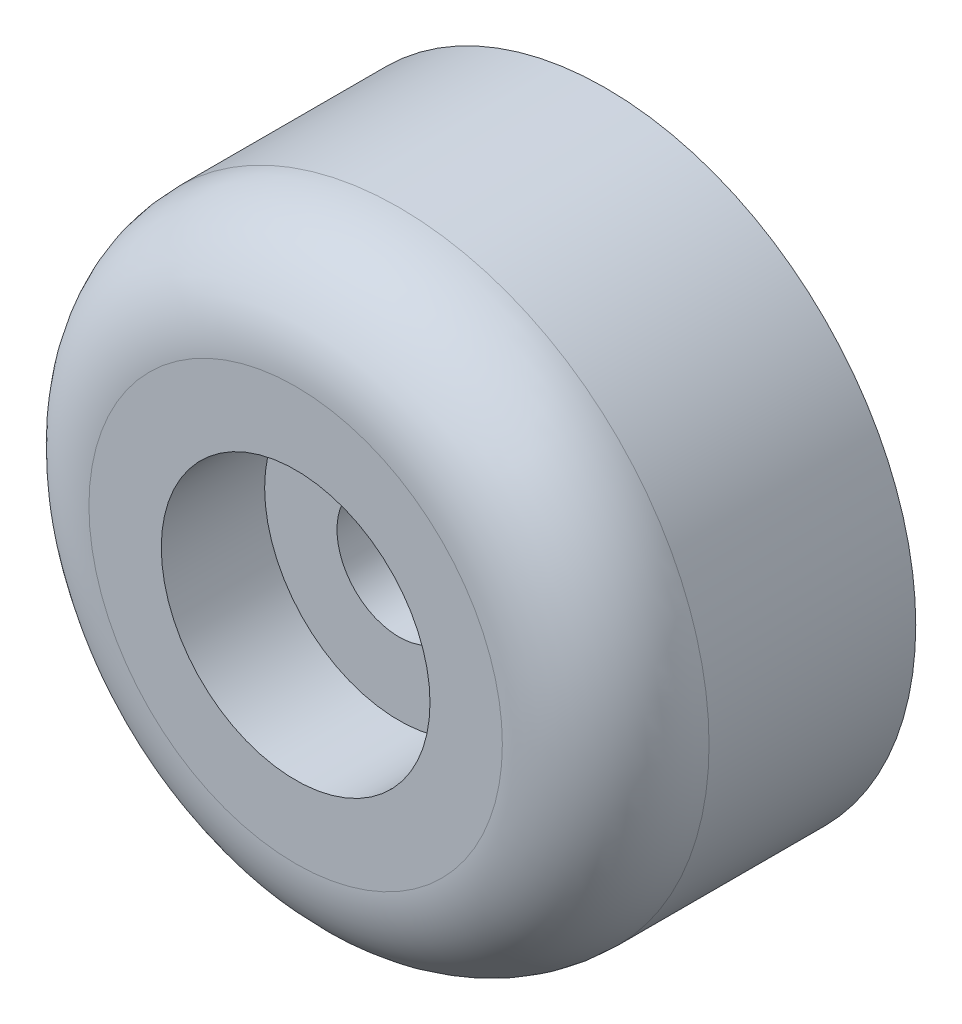
ISO-10303-21;
HEADER;
FILE_DESCRIPTION(('STEP AP214'),'2;1');
FILE_NAME('part.step','',(''),(''),'','','');
FILE_SCHEMA(('AUTOMOTIVE_DESIGN { 1 0 10303 214 1 1 1 1 }'));
ENDSEC;
DATA;
#1=APPLICATION_CONTEXT('core data for automotive mechanical design processes');
#2=APPLICATION_PROTOCOL_DEFINITION('international standard','automotive_design',2000,#1);
#3=PRODUCT_CONTEXT('',#1,'mechanical');
#4=PRODUCT('Part','Part','',(#3));
#5=PRODUCT_RELATED_PRODUCT_CATEGORY('part','',(#4));
#6=PRODUCT_DEFINITION_FORMATION('','',#4);
#7=PRODUCT_DEFINITION_CONTEXT('part definition',#1,'design');
#8=PRODUCT_DEFINITION('design','',#6,#7);
#9=PRODUCT_DEFINITION_SHAPE('','',#8);
#10=(LENGTH_UNIT() NAMED_UNIT(*) SI_UNIT(.MILLI.,.METRE.));
#11=(NAMED_UNIT(*) PLANE_ANGLE_UNIT() SI_UNIT($,.RADIAN.));
#12=(NAMED_UNIT(*) SI_UNIT($,.STERADIAN.) SOLID_ANGLE_UNIT());
#13=UNCERTAINTY_MEASURE_WITH_UNIT(LENGTH_MEASURE(1.E-05),#10,'distance_accuracy_value','');
#14=(GEOMETRIC_REPRESENTATION_CONTEXT(3) GLOBAL_UNCERTAINTY_ASSIGNED_CONTEXT((#13)) GLOBAL_UNIT_ASSIGNED_CONTEXT((#10,
#11,#12)) REPRESENTATION_CONTEXT('',''));
#15=CARTESIAN_POINT('',(0.,0.,0.));
#16=DIRECTION('',(0.,0.,1.));
#17=DIRECTION('',(1.,0.,0.));
#18=AXIS2_PLACEMENT_3D('',#15,#16,#17);
#19=CARTESIAN_POINT('',(0.,0.,15.));
#20=DIRECTION('',(0.,0.,-1.));
#21=DIRECTION('',(-1.,0.,0.));
#22=AXIS2_PLACEMENT_3D('',#19,#20,#21);
#23=CYLINDRICAL_SURFACE('',#22,3.);
#24=CARTESIAN_POINT('',(0.,0.,0.5));
#25=DIRECTION('',(0.,0.,1.));
#26=DIRECTION('',(1.,0.,0.));
#27=AXIS2_PLACEMENT_3D('',#24,#25,#26);
#28=CIRCLE('',#27,3.);
#29=CARTESIAN_POINT('',(3.,0.,0.5));
#30=VERTEX_POINT('',#29);
#31=EDGE_CURVE('E38',#30,#30,#28,.F.);
#32=ORIENTED_EDGE('',*,*,#31,.T.);
#33=EDGE_LOOP('',(#32));
#34=FACE_BOUND('',#33,.T.);
#35=CARTESIAN_POINT('',(0.,0.,10.));
#36=DIRECTION('',(0.,0.,1.));
#37=DIRECTION('',(1.,0.,0.));
#38=AXIS2_PLACEMENT_3D('',#35,#36,#37);
#39=CIRCLE('',#38,3.);
#40=CARTESIAN_POINT('',(3.,0.,10.));
#41=VERTEX_POINT('',#40);
#42=EDGE_CURVE('E49',#41,#41,#39,.F.);
#43=ORIENTED_EDGE('',*,*,#42,.F.);
#44=EDGE_LOOP('',(#43));
#45=FACE_BOUND('',#44,.T.);
#46=ADVANCED_FACE('F31',(#34,#45),#23,.F.);
#47=CARTESIAN_POINT('',(0.,0.,15.));
#48=DIRECTION('',(0.,0.,-1.));
#49=DIRECTION('',(-1.,0.,0.));
#50=AXIS2_PLACEMENT_3D('',#47,#48,#49);
#51=CYLINDRICAL_SURFACE('',#50,15.);
#52=CARTESIAN_POINT('',(0.,0.,10.));
#53=DIRECTION('',(0.,0.,1.));
#54=DIRECTION('',(1.,0.,0.));
#55=AXIS2_PLACEMENT_3D('',#52,#53,#54);
#56=CIRCLE('',#55,15.);
#57=CARTESIAN_POINT('',(15.,0.,10.));
#58=VERTEX_POINT('',#57);
#59=EDGE_CURVE('E42',#58,#58,#56,.F.);
#60=ORIENTED_EDGE('',*,*,#59,.T.);
#61=EDGE_LOOP('',(#60));
#62=FACE_BOUND('',#61,.T.);
#63=CARTESIAN_POINT('',(0.,0.,0.));
#64=DIRECTION('',(0.,0.,1.));
#65=DIRECTION('',(1.,0.,0.));
#66=AXIS2_PLACEMENT_3D('',#63,#64,#65);
#67=CIRCLE('',#66,15.);
#68=CARTESIAN_POINT('',(15.,0.,0.));
#69=VERTEX_POINT('',#68);
#70=EDGE_CURVE('E51',#69,#69,#67,.T.);
#71=ORIENTED_EDGE('',*,*,#70,.T.);
#72=EDGE_LOOP('',(#71));
#73=FACE_BOUND('',#72,.T.);
#74=ADVANCED_FACE('F77',(#62,#73),#51,.T.);
#75=CARTESIAN_POINT('',(0.,0.,15.));
#76=DIRECTION('',(0.,0.,1.));
#77=DIRECTION('',(1.,0.,0.));
#78=AXIS2_PLACEMENT_3D('',#75,#76,#77);
#79=PLANE('',#78);
#80=CARTESIAN_POINT('',(0.,0.,15.));
#81=DIRECTION('',(0.,0.,1.));
#82=DIRECTION('',(1.,0.,0.));
#83=AXIS2_PLACEMENT_3D('',#80,#81,#82);
#84=CIRCLE('',#83,6.5);
#85=CARTESIAN_POINT('',(6.5,0.,15.));
#86=VERTEX_POINT('',#85);
#87=EDGE_CURVE('E58',#86,#86,#84,.T.);
#88=ORIENTED_EDGE('',*,*,#87,.F.);
#89=EDGE_LOOP('',(#88));
#90=FACE_BOUND('',#89,.T.);
#91=CARTESIAN_POINT('',(0.,0.,15.));
#92=DIRECTION('',(0.,0.,1.));
#93=DIRECTION('',(1.,0.,0.));
#94=AXIS2_PLACEMENT_3D('',#91,#92,#93);
#95=CIRCLE('',#94,10.);
#96=CARTESIAN_POINT('',(10.,0.,15.));
#97=VERTEX_POINT('',#96);
#98=EDGE_CURVE('E46',#97,#97,#95,.T.);
#99=ORIENTED_EDGE('',*,*,#98,.T.);
#100=EDGE_LOOP('',(#99));
#101=FACE_BOUND('',#100,.T.);
#102=ADVANCED_FACE('F73',(#90,#101),#79,.T.);
#103=CARTESIAN_POINT('',(0.,0.,0.));
#104=DIRECTION('',(0.,0.,1.));
#105=DIRECTION('',(1.,0.,0.));
#106=AXIS2_PLACEMENT_3D('',#103,#104,#105);
#107=PLANE('',#106);
#108=CARTESIAN_POINT('',(0.,0.,0.));
#109=DIRECTION('',(0.,0.,1.));
#110=DIRECTION('',(1.,0.,0.));
#111=AXIS2_PLACEMENT_3D('',#108,#109,#110);
#112=CIRCLE('',#111,3.5);
#113=CARTESIAN_POINT('',(3.5,0.,0.));
#114=VERTEX_POINT('',#113);
#115=EDGE_CURVE('E10',#114,#114,#112,.T.);
#116=ORIENTED_EDGE('',*,*,#115,.T.);
#117=EDGE_LOOP('',(#116));
#118=FACE_BOUND('',#117,.T.);
#119=ORIENTED_EDGE('',*,*,#70,.F.);
#120=EDGE_LOOP('',(#119));
#121=FACE_BOUND('',#120,.T.);
#122=ADVANCED_FACE('F76',(#118,#121),#107,.F.);
#123=CARTESIAN_POINT('',(0.,0.,10.));
#124=DIRECTION('',(0.,0.,1.));
#125=DIRECTION('',(1.,0.,0.));
#126=AXIS2_PLACEMENT_3D('',#123,#124,#125);
#127=TOROIDAL_SURFACE('',#126,10.,5.);
#128=ORIENTED_EDGE('',*,*,#59,.F.);
#129=EDGE_LOOP('',(#128));
#130=FACE_BOUND('',#129,.T.);
#131=ORIENTED_EDGE('',*,*,#98,.F.);
#132=EDGE_LOOP('',(#131));
#133=FACE_BOUND('',#132,.T.);
#134=ADVANCED_FACE('F81',(#130,#133),#127,.T.);
#135=CARTESIAN_POINT('',(0.,0.,10.));
#136=DIRECTION('',(0.,0.,1.));
#137=DIRECTION('',(1.,0.,0.));
#138=AXIS2_PLACEMENT_3D('',#135,#136,#137);
#139=PLANE('',#138);
#140=CARTESIAN_POINT('',(0.,0.,10.));
#141=DIRECTION('',(0.,0.,1.));
#142=DIRECTION('',(1.,0.,0.));
#143=AXIS2_PLACEMENT_3D('',#140,#141,#142);
#144=CIRCLE('',#143,6.5);
#145=CARTESIAN_POINT('',(6.5,0.,10.));
#146=VERTEX_POINT('',#145);
#147=EDGE_CURVE('E52',#146,#146,#144,.T.);
#148=ORIENTED_EDGE('',*,*,#147,.T.);
#149=EDGE_LOOP('',(#148));
#150=FACE_BOUND('',#149,.T.);
#151=ORIENTED_EDGE('',*,*,#42,.T.);
#152=EDGE_LOOP('',(#151));
#153=FACE_BOUND('',#152,.T.);
#154=ADVANCED_FACE('F64',(#150,#153),#139,.T.);
#155=CARTESIAN_POINT('',(0.,0.,10.));
#156=DIRECTION('',(0.,0.,1.));
#157=DIRECTION('',(1.,0.,0.));
#158=AXIS2_PLACEMENT_3D('',#155,#156,#157);
#159=CYLINDRICAL_SURFACE('',#158,6.5);
#160=ORIENTED_EDGE('',*,*,#147,.F.);
#161=EDGE_LOOP('',(#160));
#162=FACE_BOUND('',#161,.T.);
#163=ORIENTED_EDGE('',*,*,#87,.T.);
#164=EDGE_LOOP('',(#163));
#165=FACE_BOUND('',#164,.T.);
#166=ADVANCED_FACE('F67',(#162,#165),#159,.F.);
#167=CARTESIAN_POINT('',(0.,0.,0.5));
#168=DIRECTION('',(0.,0.,1.));
#169=DIRECTION('',(1.,0.,0.));
#170=AXIS2_PLACEMENT_3D('',#167,#168,#169);
#171=TOROIDAL_SURFACE('',#170,3.5,0.5);
#172=ORIENTED_EDGE('',*,*,#115,.F.);
#173=EDGE_LOOP('',(#172));
#174=FACE_BOUND('',#173,.T.);
#175=ORIENTED_EDGE('',*,*,#31,.F.);
#176=EDGE_LOOP('',(#175));
#177=FACE_BOUND('',#176,.T.);
#178=ADVANCED_FACE('F33',(#174,#177),#171,.T.);
#179=CLOSED_SHELL('',(#46,#74,#102,#122,#134,#154,#166,#178));
#180=MANIFOLD_SOLID_BREP('B2',#179);
#181=ADVANCED_BREP_SHAPE_REPRESENTATION('',(#18,#180),#14);
#182=SHAPE_DEFINITION_REPRESENTATION(#9,#181);
ENDSEC;
END-ISO-10303-21;
